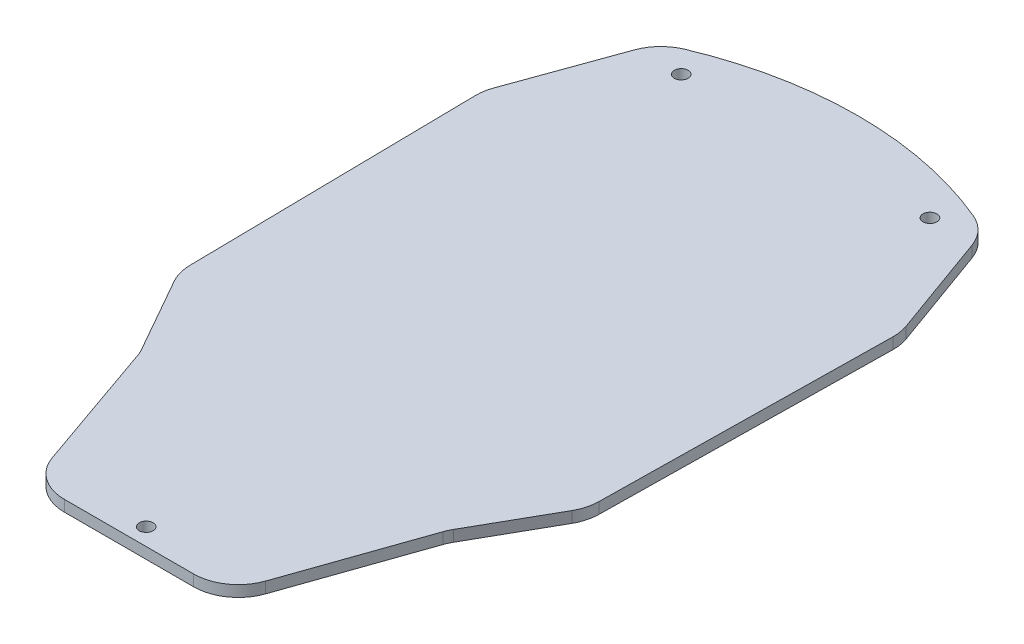
ISO-10303-21;
HEADER;
FILE_DESCRIPTION(('STEP AP214'),'2;1');
FILE_NAME('part.step','',(''),(''),'','','');
FILE_SCHEMA(('AUTOMOTIVE_DESIGN { 1 0 10303 214 1 1 1 1 }'));
ENDSEC;
DATA;
#1=APPLICATION_CONTEXT('core data for automotive mechanical design processes');
#2=APPLICATION_PROTOCOL_DEFINITION('international standard','automotive_design',2000,#1);
#3=PRODUCT_CONTEXT('',#1,'mechanical');
#4=PRODUCT('Part','Part','',(#3));
#5=PRODUCT_RELATED_PRODUCT_CATEGORY('part','',(#4));
#6=PRODUCT_DEFINITION_FORMATION('','',#4);
#7=PRODUCT_DEFINITION_CONTEXT('part definition',#1,'design');
#8=PRODUCT_DEFINITION('design','',#6,#7);
#9=PRODUCT_DEFINITION_SHAPE('','',#8);
#10=(LENGTH_UNIT() NAMED_UNIT(*) SI_UNIT(.MILLI.,.METRE.));
#11=(NAMED_UNIT(*) PLANE_ANGLE_UNIT() SI_UNIT($,.RADIAN.));
#12=(NAMED_UNIT(*) SI_UNIT($,.STERADIAN.) SOLID_ANGLE_UNIT());
#13=UNCERTAINTY_MEASURE_WITH_UNIT(LENGTH_MEASURE(1.E-05),#10,'distance_accuracy_value','');
#14=(GEOMETRIC_REPRESENTATION_CONTEXT(3) GLOBAL_UNCERTAINTY_ASSIGNED_CONTEXT((#13)) GLOBAL_UNIT_ASSIGNED_CONTEXT((#10,
#11,#12)) REPRESENTATION_CONTEXT('',''));
#15=CARTESIAN_POINT('',(0.,0.,0.));
#16=DIRECTION('',(0.,0.,1.));
#17=DIRECTION('',(1.,0.,0.));
#18=AXIS2_PLACEMENT_3D('',#15,#16,#17);
#19=CARTESIAN_POINT('',(-59.5778963500326,3.175,-162.152192035586));
#20=DIRECTION('',(-0.940552015487436,0.,-0.339649681528662));
#21=DIRECTION('',(-0.339649681528662,0.,0.940552015487436));
#22=AXIS2_PLACEMENT_3D('',#19,#20,#21);
#23=PLANE('',#22);
#24=DIRECTION('',(0.339649681528662,0.,-0.940552015487436));
#25=VECTOR('',#24,1.);
#26=CARTESIAN_POINT('',(-59.5778963500326,3.175,-162.152192035586));
#27=LINE('',#26,#25);
#28=CARTESIAN_POINT('',(-58.7896777469841,3.175,-164.334913339505));
#29=VERTEX_POINT('',#28);
#30=CARTESIAN_POINT('',(-48.1726179921892,3.175,-193.735491329095));
#31=VERTEX_POINT('',#30);
#32=EDGE_CURVE('E355',#29,#31,#27,.T.);
#33=ORIENTED_EDGE('',*,*,#32,.T.);
#34=DIRECTION('',(0.,-1.,0.));
#35=VECTOR('',#34,1.);
#36=CARTESIAN_POINT('',(-48.1726179921892,3.175,-193.735491329095));
#37=LINE('',#36,#35);
#38=CARTESIAN_POINT('',(-48.1726179921892,0.,-193.735491329095));
#39=VERTEX_POINT('',#38);
#40=EDGE_CURVE('E190',#31,#39,#37,.T.);
#41=ORIENTED_EDGE('',*,*,#40,.T.);
#42=DIRECTION('',(0.339649681528662,0.,-0.940552015487436));
#43=VECTOR('',#42,1.);
#44=CARTESIAN_POINT('',(-59.5778963500326,0.,-162.152192035586));
#45=LINE('',#44,#43);
#46=CARTESIAN_POINT('',(-58.7896777469841,0.,-164.334913339505));
#47=VERTEX_POINT('',#46);
#48=EDGE_CURVE('E174',#47,#39,#45,.T.);
#49=ORIENTED_EDGE('',*,*,#48,.F.);
#50=DIRECTION('',(0.,-1.,0.));
#51=VECTOR('',#50,1.);
#52=CARTESIAN_POINT('',(-58.7896777469841,3.175,-164.334913339505));
#53=LINE('',#52,#51);
#54=EDGE_CURVE('E187',#47,#29,#53,.F.);
#55=ORIENTED_EDGE('',*,*,#54,.T.);
#56=EDGE_LOOP('',(#33,#41,#49,#55));
#57=FACE_BOUND('',#56,.T.);
#58=ADVANCED_FACE('F33',(#57),#23,.T.);
#59=CARTESIAN_POINT('',(-58.2611403441786,3.175,-73.958269637992));
#60=DIRECTION('',(-0.999888562668412,0.,0.0149285714285713));
#61=DIRECTION('',(0.0149285714285713,0.,0.999888562668412));
#62=AXIS2_PLACEMENT_3D('',#59,#60,#61);
#63=PLANE('',#62);
#64=DIRECTION('',(-0.0149285714285713,0.,-0.999888562668412));
#65=VECTOR('',#64,1.);
#66=CARTESIAN_POINT('',(-58.2611403441786,0.,-73.958269637992));
#67=LINE('',#66,#65);
#68=CARTESIAN_POINT('',(-58.3096478434964,0.,-77.2072137183785));
#69=VERTEX_POINT('',#68);
#70=CARTESIAN_POINT('',(-59.5432518961825,0.,-159.831769526948));
#71=VERTEX_POINT('',#70);
#72=EDGE_CURVE('E176',#69,#71,#67,.T.);
#73=ORIENTED_EDGE('',*,*,#72,.F.);
#74=DIRECTION('',(0.,-1.,0.));
#75=VECTOR('',#74,1.);
#76=CARTESIAN_POINT('',(-58.3096478434964,3.175,-77.2072137183785));
#77=LINE('',#76,#75);
#78=CARTESIAN_POINT('',(-58.3096478434964,3.175,-77.2072137183785));
#79=VERTEX_POINT('',#78);
#80=EDGE_CURVE('E273',#69,#79,#77,.F.);
#81=ORIENTED_EDGE('',*,*,#80,.T.);
#82=DIRECTION('',(-0.0149285714285713,0.,-0.999888562668412));
#83=VECTOR('',#82,1.);
#84=CARTESIAN_POINT('',(-58.2611403441786,3.175,-73.958269637992));
#85=LINE('',#84,#83);
#86=CARTESIAN_POINT('',(-59.5432518961825,3.175,-159.831769526948));
#87=VERTEX_POINT('',#86);
#88=EDGE_CURVE('E197',#79,#87,#85,.T.);
#89=ORIENTED_EDGE('',*,*,#88,.T.);
#90=DIRECTION('',(0.,-1.,0.));
#91=VECTOR('',#90,1.);
#92=CARTESIAN_POINT('',(-59.5432518961825,3.175,-159.831769526948));
#93=LINE('',#92,#91);
#94=EDGE_CURVE('E271',#87,#71,#93,.T.);
#95=ORIENTED_EDGE('',*,*,#94,.T.);
#96=EDGE_LOOP('',(#73,#81,#89,#95));
#97=FACE_BOUND('',#96,.T.);
#98=ADVANCED_FACE('F401',(#97),#63,.T.);
#99=CARTESIAN_POINT('',(-43.8875961045043,3.175,-48.6130264916214));
#100=DIRECTION('',(-0.869856675044697,0.,0.493304535637149));
#101=DIRECTION('',(0.493304535637149,0.,0.869856675044698));
#102=AXIS2_PLACEMENT_3D('',#99,#100,#101);
#103=PLANE('',#102);
#104=DIRECTION('',(-0.493304535637149,0.,-0.869856675044698));
#105=VECTOR('',#104,1.);
#106=CARTESIAN_POINT('',(-43.8875961045043,0.,-48.6130264916214));
#107=LINE('',#106,#105);
#108=CARTESIAN_POINT('',(-44.4516474954024,0.,-49.6076329304357));
#109=VERTEX_POINT('',#108);
#110=CARTESIAN_POINT('',(-56.6582428706752,0.,-71.1318389729296));
#111=VERTEX_POINT('',#110);
#112=EDGE_CURVE('E281',#109,#111,#107,.T.);
#113=ORIENTED_EDGE('',*,*,#112,.F.);
#114=DIRECTION('',(0.,-1.,0.));
#115=VECTOR('',#114,1.);
#116=CARTESIAN_POINT('',(-44.4516474954024,3.175,-49.6076329304357));
#117=LINE('',#116,#115);
#118=CARTESIAN_POINT('',(-44.4516474954024,3.175,-49.6076329304357));
#119=VERTEX_POINT('',#118);
#120=EDGE_CURVE('E269',#109,#119,#117,.F.);
#121=ORIENTED_EDGE('',*,*,#120,.T.);
#122=DIRECTION('',(-0.493304535637149,0.,-0.869856675044698));
#123=VECTOR('',#122,1.);
#124=CARTESIAN_POINT('',(-43.8875961045043,3.175,-48.6130264916214));
#125=LINE('',#124,#123);
#126=CARTESIAN_POINT('',(-56.6582428706752,3.175,-71.1318389729296));
#127=VERTEX_POINT('',#126);
#128=EDGE_CURVE('E201',#119,#127,#125,.T.);
#129=ORIENTED_EDGE('',*,*,#128,.T.);
#130=DIRECTION('',(0.,-1.,0.));
#131=VECTOR('',#130,1.);
#132=CARTESIAN_POINT('',(-56.6582428706752,3.175,-71.1318389729296));
#133=LINE('',#132,#131);
#134=EDGE_CURVE('E266',#127,#111,#133,.T.);
#135=ORIENTED_EDGE('',*,*,#134,.T.);
#136=EDGE_LOOP('',(#113,#121,#129,#135));
#137=FACE_BOUND('',#136,.T.);
#138=ADVANCED_FACE('F288',(#137),#103,.T.);
#139=CARTESIAN_POINT('',(-27.4482558424307,3.175,-1.5875));
#140=DIRECTION('',(-0.943980932010811,0.,0.33));
#141=DIRECTION('',(0.33,0.,0.943980932010811));
#142=AXIS2_PLACEMENT_3D('',#139,#140,#141);
#143=PLANE('',#142);
#144=DIRECTION('',(-0.33,0.,-0.943980932010811));
#145=VECTOR('',#144,1.);
#146=CARTESIAN_POINT('',(-27.4482558424307,3.175,-1.5875));
#147=LINE('',#146,#145);
#148=CARTESIAN_POINT('',(-30.4228604184136,3.175,-10.0965));
#149=VERTEX_POINT('',#148);
#150=CARTESIAN_POINT('',(-43.5102694319328,3.175,-47.5336653278439));
#151=VERTEX_POINT('',#150);
#152=EDGE_CURVE('E298',#149,#151,#147,.T.);
#153=ORIENTED_EDGE('',*,*,#152,.T.);
#154=DIRECTION('',(0.,-1.,0.));
#155=VECTOR('',#154,1.);
#156=CARTESIAN_POINT('',(-43.5102694319328,0.,-47.5336653278439));
#157=LINE('',#156,#155);
#158=CARTESIAN_POINT('',(-43.5102694319328,0.,-47.5336653278439));
#159=VERTEX_POINT('',#158);
#160=EDGE_CURVE('E263',#151,#159,#157,.T.);
#161=ORIENTED_EDGE('',*,*,#160,.T.);
#162=DIRECTION('',(-0.33,0.,-0.943980932010811));
#163=VECTOR('',#162,1.);
#164=CARTESIAN_POINT('',(-27.4482558424307,0.,-1.5875));
#165=LINE('',#164,#163);
#166=CARTESIAN_POINT('',(-30.4228604184136,0.,-10.0965));
#167=VERTEX_POINT('',#166);
#168=EDGE_CURVE('E283',#167,#159,#165,.T.);
#169=ORIENTED_EDGE('',*,*,#168,.F.);
#170=DIRECTION('',(0.,-1.,0.));
#171=VECTOR('',#170,1.);
#172=CARTESIAN_POINT('',(-30.4228604184136,3.175,-10.0965));
#173=LINE('',#172,#171);
#174=EDGE_CURVE('E261',#167,#149,#173,.F.);
#175=ORIENTED_EDGE('',*,*,#174,.T.);
#176=EDGE_LOOP('',(#153,#161,#169,#175));
#177=FACE_BOUND('',#176,.T.);
#178=ADVANCED_FACE('F301',(#177),#143,.T.);
#179=CARTESIAN_POINT('',(-27.4482558424307,3.175,-1.5875));
#180=DIRECTION('',(0.,0.,-1.));
#181=DIRECTION('',(-1.,0.,0.));
#182=AXIS2_PLACEMENT_3D('',#179,#180,#181);
#183=PLANE('',#182);
#184=DIRECTION('',(1.,0.,0.));
#185=VECTOR('',#184,1.);
#186=CARTESIAN_POINT('',(-27.4482558424307,0.,-1.5875));
#187=LINE('',#186,#185);
#188=CARTESIAN_POINT('',(-18.4343025818763,0.,-1.5875));
#189=VERTEX_POINT('',#188);
#190=CARTESIAN_POINT('',(18.4343025818763,0.,-1.5875));
#191=VERTEX_POINT('',#190);
#192=EDGE_CURVE('E324',#189,#191,#187,.T.);
#193=ORIENTED_EDGE('',*,*,#192,.T.);
#194=DIRECTION('',(0.,-1.,0.));
#195=VECTOR('',#194,1.);
#196=CARTESIAN_POINT('',(18.4343025818763,3.175,-1.5875));
#197=LINE('',#196,#195);
#198=CARTESIAN_POINT('',(18.4343025818763,3.175,-1.5875));
#199=VERTEX_POINT('',#198);
#200=EDGE_CURVE('E259',#191,#199,#197,.F.);
#201=ORIENTED_EDGE('',*,*,#200,.T.);
#202=DIRECTION('',(1.,0.,0.));
#203=VECTOR('',#202,1.);
#204=CARTESIAN_POINT('',(-27.4482558424307,3.175,-1.5875));
#205=LINE('',#204,#203);
#206=CARTESIAN_POINT('',(-18.4343025818763,3.175,-1.5875));
#207=VERTEX_POINT('',#206);
#208=EDGE_CURVE('E303',#207,#199,#205,.T.);
#209=ORIENTED_EDGE('',*,*,#208,.F.);
#210=DIRECTION('',(0.,-1.,0.));
#211=VECTOR('',#210,1.);
#212=CARTESIAN_POINT('',(-18.4343025818763,0.,-1.5875));
#213=LINE('',#212,#211);
#214=EDGE_CURVE('E256',#207,#189,#213,.T.);
#215=ORIENTED_EDGE('',*,*,#214,.T.);
#216=EDGE_LOOP('',(#193,#201,#209,#215));
#217=FACE_BOUND('',#216,.T.);
#218=ADVANCED_FACE('F330',(#217),#183,.F.);
#219=CARTESIAN_POINT('',(27.4482558424307,3.175,-1.5875));
#220=DIRECTION('',(-0.943980932010811,0.,-0.33));
#221=DIRECTION('',(-0.33,0.,0.943980932010811));
#222=AXIS2_PLACEMENT_3D('',#219,#220,#221);
#223=PLANE('',#222);
#224=DIRECTION('',(0.33,0.,-0.943980932010811));
#225=VECTOR('',#224,1.);
#226=CARTESIAN_POINT('',(27.4482558424307,0.,-1.5875));
#227=LINE('',#226,#225);
#228=CARTESIAN_POINT('',(30.4228604184136,0.,-10.0965));
#229=VERTEX_POINT('',#228);
#230=CARTESIAN_POINT('',(43.5102694319328,0.,-47.533665327844));
#231=VERTEX_POINT('',#230);
#232=EDGE_CURVE('E321',#229,#231,#227,.T.);
#233=ORIENTED_EDGE('',*,*,#232,.T.);
#234=DIRECTION('',(0.,-1.,0.));
#235=VECTOR('',#234,1.);
#236=CARTESIAN_POINT('',(43.5102694319328,3.175,-47.533665327844));
#237=LINE('',#236,#235);
#238=CARTESIAN_POINT('',(43.5102694319328,3.175,-47.533665327844));
#239=VERTEX_POINT('',#238);
#240=EDGE_CURVE('E254',#231,#239,#237,.F.);
#241=ORIENTED_EDGE('',*,*,#240,.T.);
#242=DIRECTION('',(0.33,0.,-0.943980932010811));
#243=VECTOR('',#242,1.);
#244=CARTESIAN_POINT('',(27.4482558424307,3.175,-1.5875));
#245=LINE('',#244,#243);
#246=CARTESIAN_POINT('',(30.4228604184136,3.175,-10.0965));
#247=VERTEX_POINT('',#246);
#248=EDGE_CURVE('E307',#247,#239,#245,.T.);
#249=ORIENTED_EDGE('',*,*,#248,.F.);
#250=DIRECTION('',(0.,-1.,0.));
#251=VECTOR('',#250,1.);
#252=CARTESIAN_POINT('',(30.4228604184136,3.175,-10.0965));
#253=LINE('',#252,#251);
#254=EDGE_CURVE('E251',#247,#229,#253,.T.);
#255=ORIENTED_EDGE('',*,*,#254,.T.);
#256=EDGE_LOOP('',(#233,#241,#249,#255));
#257=FACE_BOUND('',#256,.T.);
#258=ADVANCED_FACE('F341',(#257),#223,.F.);
#259=CARTESIAN_POINT('',(43.8875961045043,3.175,-48.6130264916214));
#260=DIRECTION('',(-0.869856675044697,0.,-0.493304535637149));
#261=DIRECTION('',(-0.493304535637149,0.,0.869856675044698));
#262=AXIS2_PLACEMENT_3D('',#259,#260,#261);
#263=PLANE('',#262);
#264=DIRECTION('',(0.493304535637149,0.,-0.869856675044698));
#265=VECTOR('',#264,1.);
#266=CARTESIAN_POINT('',(43.8875961045043,0.,-48.6130264916214));
#267=LINE('',#266,#265);
#268=CARTESIAN_POINT('',(44.4516474954025,0.,-49.6076329304357));
#269=VERTEX_POINT('',#268);
#270=CARTESIAN_POINT('',(56.6582428706752,0.,-71.1318389729296));
#271=VERTEX_POINT('',#270);
#272=EDGE_CURVE('E318',#269,#271,#267,.T.);
#273=ORIENTED_EDGE('',*,*,#272,.T.);
#274=DIRECTION('',(0.,-1.,0.));
#275=VECTOR('',#274,1.);
#276=CARTESIAN_POINT('',(56.6582428706752,3.175,-71.1318389729296));
#277=LINE('',#276,#275);
#278=CARTESIAN_POINT('',(56.6582428706752,3.175,-71.1318389729296));
#279=VERTEX_POINT('',#278);
#280=EDGE_CURVE('E249',#271,#279,#277,.F.);
#281=ORIENTED_EDGE('',*,*,#280,.T.);
#282=DIRECTION('',(0.493304535637149,0.,-0.869856675044698));
#283=VECTOR('',#282,1.);
#284=CARTESIAN_POINT('',(43.8875961045043,3.175,-48.6130264916214));
#285=LINE('',#284,#283);
#286=CARTESIAN_POINT('',(44.4516474954025,3.175,-49.6076329304357));
#287=VERTEX_POINT('',#286);
#288=EDGE_CURVE('E344',#287,#279,#285,.T.);
#289=ORIENTED_EDGE('',*,*,#288,.F.);
#290=DIRECTION('',(0.,-1.,0.));
#291=VECTOR('',#290,1.);
#292=CARTESIAN_POINT('',(44.4516474954025,0.,-49.6076329304357));
#293=LINE('',#292,#291);
#294=EDGE_CURVE('E246',#287,#269,#293,.T.);
#295=ORIENTED_EDGE('',*,*,#294,.T.);
#296=EDGE_LOOP('',(#273,#281,#289,#295));
#297=FACE_BOUND('',#296,.T.);
#298=ADVANCED_FACE('F528',(#297),#263,.F.);
#299=CARTESIAN_POINT('',(58.2611403441786,3.175,-73.958269637992));
#300=DIRECTION('',(-0.999888562668412,0.,-0.0149285714285713));
#301=DIRECTION('',(-0.0149285714285713,0.,0.999888562668412));
#302=AXIS2_PLACEMENT_3D('',#299,#300,#301);
#303=PLANE('',#302);
#304=DIRECTION('',(0.0149285714285713,0.,-0.999888562668412));
#305=VECTOR('',#304,1.);
#306=CARTESIAN_POINT('',(58.2611403441786,0.,-73.958269637992));
#307=LINE('',#306,#305);
#308=CARTESIAN_POINT('',(58.3096478434964,0.,-77.2072137183785));
#309=VERTEX_POINT('',#308);
#310=CARTESIAN_POINT('',(59.5432518961825,0.,-159.831769526948));
#311=VERTEX_POINT('',#310);
#312=EDGE_CURVE('E315',#309,#311,#307,.T.);
#313=ORIENTED_EDGE('',*,*,#312,.T.);
#314=DIRECTION('',(0.,-1.,0.));
#315=VECTOR('',#314,1.);
#316=CARTESIAN_POINT('',(59.5432518961825,3.175,-159.831769526948));
#317=LINE('',#316,#315);
#318=CARTESIAN_POINT('',(59.5432518961825,3.175,-159.831769526948));
#319=VERTEX_POINT('',#318);
#320=EDGE_CURVE('E244',#311,#319,#317,.F.);
#321=ORIENTED_EDGE('',*,*,#320,.T.);
#322=DIRECTION('',(0.0149285714285713,0.,-0.999888562668412));
#323=VECTOR('',#322,1.);
#324=CARTESIAN_POINT('',(58.2611403441786,3.175,-73.958269637992));
#325=LINE('',#324,#323);
#326=CARTESIAN_POINT('',(58.3096478434964,3.175,-77.2072137183785));
#327=VERTEX_POINT('',#326);
#328=EDGE_CURVE('E346',#327,#319,#325,.T.);
#329=ORIENTED_EDGE('',*,*,#328,.F.);
#330=DIRECTION('',(0.,-1.,0.));
#331=VECTOR('',#330,1.);
#332=CARTESIAN_POINT('',(58.3096478434964,3.175,-77.2072137183785));
#333=LINE('',#332,#331);
#334=EDGE_CURVE('E241',#327,#309,#333,.T.);
#335=ORIENTED_EDGE('',*,*,#334,.T.);
#336=EDGE_LOOP('',(#313,#321,#329,#335));
#337=FACE_BOUND('',#336,.T.);
#338=ADVANCED_FACE('F522',(#337),#303,.F.);
#339=CARTESIAN_POINT('',(59.5778963500326,3.175,-162.152192035586));
#340=DIRECTION('',(-0.940552015487436,0.,0.339649681528662));
#341=DIRECTION('',(0.339649681528662,0.,0.940552015487436));
#342=AXIS2_PLACEMENT_3D('',#339,#340,#341);
#343=PLANE('',#342);
#344=DIRECTION('',(-0.339649681528662,0.,-0.940552015487436));
#345=VECTOR('',#344,1.);
#346=CARTESIAN_POINT('',(59.5778963500326,0.,-162.152192035586));
#347=LINE('',#346,#345);
#348=CARTESIAN_POINT('',(58.7896777469841,0.,-164.334913339505));
#349=VERTEX_POINT('',#348);
#350=CARTESIAN_POINT('',(48.1726179921892,0.,-193.735491329095));
#351=VERTEX_POINT('',#350);
#352=EDGE_CURVE('E313',#349,#351,#347,.T.);
#353=ORIENTED_EDGE('',*,*,#352,.T.);
#354=DIRECTION('',(0.,1.,0.));
#355=VECTOR('',#354,1.);
#356=CARTESIAN_POINT('',(48.1726179921892,3.175,-193.735491329095));
#357=LINE('',#356,#355);
#358=CARTESIAN_POINT('',(48.1726179921892,3.175,-193.735491329095));
#359=VERTEX_POINT('',#358);
#360=EDGE_CURVE('E48',#351,#359,#357,.T.);
#361=ORIENTED_EDGE('',*,*,#360,.T.);
#362=DIRECTION('',(-0.339649681528662,0.,-0.940552015487436));
#363=VECTOR('',#362,1.);
#364=CARTESIAN_POINT('',(59.5778963500326,3.175,-162.152192035586));
#365=LINE('',#364,#363);
#366=CARTESIAN_POINT('',(58.7896777469841,3.175,-164.334913339505));
#367=VERTEX_POINT('',#366);
#368=EDGE_CURVE('E350',#367,#359,#365,.T.);
#369=ORIENTED_EDGE('',*,*,#368,.F.);
#370=DIRECTION('',(0.,-1.,0.));
#371=VECTOR('',#370,1.);
#372=CARTESIAN_POINT('',(58.7896777469841,3.175,-164.334913339505));
#373=LINE('',#372,#371);
#374=EDGE_CURVE('E237',#367,#349,#373,.T.);
#375=ORIENTED_EDGE('',*,*,#374,.T.);
#376=EDGE_LOOP('',(#353,#361,#369,#375));
#377=FACE_BOUND('',#376,.T.);
#378=ADVANCED_FACE('F515',(#377),#343,.F.);
#379=CARTESIAN_POINT('',(0.,3.175,-103.049349995439));
#380=DIRECTION('',(0.,-1.,0.));
#381=DIRECTION('',(0.,0.,-1.));
#382=AXIS2_PLACEMENT_3D('',#379,#380,#381);
#383=CYLINDRICAL_SURFACE('',#382,106.3625);
#384=CARTESIAN_POINT('',(0.,0.,-103.049349995439));
#385=DIRECTION('',(0.,-1.,0.));
#386=DIRECTION('',(0.,0.,-1.));
#387=AXIS2_PLACEMENT_3D('',#384,#385,#386);
#388=CIRCLE('',#387,106.3625);
#389=CARTESIAN_POINT('',(-41.1398253474308,0.,-201.133478052087));
#390=VERTEX_POINT('',#389);
#391=CARTESIAN_POINT('',(41.1398253474308,0.,-201.133478052087));
#392=VERTEX_POINT('',#391);
#393=EDGE_CURVE('E191',#390,#392,#388,.T.);
#394=ORIENTED_EDGE('',*,*,#393,.F.);
#395=DIRECTION('',(0.,-1.,0.));
#396=VECTOR('',#395,1.);
#397=CARTESIAN_POINT('',(-41.1398253474307,3.175,-201.133478052087));
#398=LINE('',#397,#396);
#399=CARTESIAN_POINT('',(-41.1398253474308,3.175,-201.133478052087));
#400=VERTEX_POINT('',#399);
#401=EDGE_CURVE('E221',#390,#400,#398,.F.);
#402=ORIENTED_EDGE('',*,*,#401,.T.);
#403=CARTESIAN_POINT('',(0.,3.175,-103.049349995439));
#404=DIRECTION('',(0.,-1.,0.));
#405=DIRECTION('',(0.,0.,-1.));
#406=AXIS2_PLACEMENT_3D('',#403,#404,#405);
#407=CIRCLE('',#406,106.3625);
#408=CARTESIAN_POINT('',(41.1398253474308,3.175,-201.133478052087));
#409=VERTEX_POINT('',#408);
#410=EDGE_CURVE('E352',#400,#409,#407,.T.);
#411=ORIENTED_EDGE('',*,*,#410,.T.);
#412=DIRECTION('',(0.,-1.,0.));
#413=VECTOR('',#412,1.);
#414=CARTESIAN_POINT('',(41.1398253474307,3.175,-201.133478052087));
#415=LINE('',#414,#413);
#416=EDGE_CURVE('E218',#409,#392,#415,.T.);
#417=ORIENTED_EDGE('',*,*,#416,.T.);
#418=EDGE_LOOP('',(#394,#402,#411,#417));
#419=FACE_BOUND('',#418,.T.);
#420=ADVANCED_FACE('F379',(#419),#383,.T.);
#421=CARTESIAN_POINT('',(0.,3.175,-103.049349995439));
#422=DIRECTION('',(0.,-1.,0.));
#423=DIRECTION('',(0.,0.,-1.));
#424=AXIS2_PLACEMENT_3D('',#421,#422,#423);
#425=PLANE('',#424);
#426=CARTESIAN_POINT('',(0.,3.175,-6.48335));
#427=DIRECTION('',(0.,1.,0.));
#428=DIRECTION('',(0.,0.,1.));
#429=AXIS2_PLACEMENT_3D('',#426,#427,#428);
#430=CIRCLE('',#429,1.98437499999999);
#431=CARTESIAN_POINT('',(0.,3.175,-4.49897500000001));
#432=VERTEX_POINT('',#431);
#433=EDGE_CURVE('E371',#432,#432,#430,.T.);
#434=ORIENTED_EDGE('',*,*,#433,.F.);
#435=EDGE_LOOP('',(#434));
#436=FACE_BOUND('',#435,.T.);
#437=CARTESIAN_POINT('',(-35.45205,3.175,-194.449583063944));
#438=DIRECTION('',(0.,1.,0.));
#439=DIRECTION('',(0.,0.,1.));
#440=AXIS2_PLACEMENT_3D('',#437,#438,#439);
#441=CIRCLE('',#440,1.984375);
#442=CARTESIAN_POINT('',(-35.45205,3.175,-192.465208063944));
#443=VERTEX_POINT('',#442);
#444=EDGE_CURVE('E365',#443,#443,#441,.T.);
#445=ORIENTED_EDGE('',*,*,#444,.F.);
#446=EDGE_LOOP('',(#445));
#447=FACE_BOUND('',#446,.T.);
#448=CARTESIAN_POINT('',(35.45205,3.175,-194.449583063944));
#449=DIRECTION('',(0.,1.,0.));
#450=DIRECTION('',(0.,0.,1.));
#451=AXIS2_PLACEMENT_3D('',#448,#449,#450);
#452=CIRCLE('',#451,1.984375);
#453=CARTESIAN_POINT('',(35.45205,3.175,-192.465208063944));
#454=VERTEX_POINT('',#453);
#455=EDGE_CURVE('E359',#454,#454,#452,.T.);
#456=ORIENTED_EDGE('',*,*,#455,.F.);
#457=EDGE_LOOP('',(#456));
#458=FACE_BOUND('',#457,.T.);
#459=ORIENTED_EDGE('',*,*,#410,.F.);
#460=CARTESIAN_POINT('',(-36.2276073954987,3.175,-189.421940373681));
#461=DIRECTION('',(0.,-1.,0.));
#462=DIRECTION('',(0.,0.,-1.));
#463=AXIS2_PLACEMENT_3D('',#460,#461,#462);
#464=CIRCLE('',#463,12.7);
#465=EDGE_CURVE('E235',#400,#31,#464,.F.);
#466=ORIENTED_EDGE('',*,*,#465,.T.);
#467=ORIENTED_EDGE('',*,*,#32,.F.);
#468=CARTESIAN_POINT('',(-46.8446671502936,3.175,-160.021362384091));
#469=DIRECTION('',(0.,-1.,0.));
#470=DIRECTION('',(0.,0.,-1.));
#471=AXIS2_PLACEMENT_3D('',#468,#469,#470);
#472=CIRCLE('',#471,12.7);
#473=EDGE_CURVE('E196',#29,#87,#472,.F.);
#474=ORIENTED_EDGE('',*,*,#473,.T.);
#475=ORIENTED_EDGE('',*,*,#88,.F.);
#476=CARTESIAN_POINT('',(-45.6110630976076,3.175,-77.3968065755214));
#477=DIRECTION('',(0.,-1.,0.));
#478=DIRECTION('',(0.,0.,-1.));
#479=AXIS2_PLACEMENT_3D('',#476,#477,#478);
#480=CIRCLE('',#479,12.7);
#481=EDGE_CURVE('E226',#79,#127,#480,.F.);
#482=ORIENTED_EDGE('',*,*,#481,.T.);
#483=ORIENTED_EDGE('',*,*,#128,.F.);
#484=CARTESIAN_POINT('',(-55.4988272684701,3.175,-43.3426653278439));
#485=DIRECTION('',(0.,-1.,0.));
#486=DIRECTION('',(0.,0.,-1.));
#487=AXIS2_PLACEMENT_3D('',#484,#485,#486);
#488=CIRCLE('',#487,12.7);
#489=EDGE_CURVE('E11',#119,#151,#488,.T.);
#490=ORIENTED_EDGE('',*,*,#489,.T.);
#491=ORIENTED_EDGE('',*,*,#152,.F.);
#492=CARTESIAN_POINT('',(-18.4343025818763,3.175,-14.2875));
#493=DIRECTION('',(0.,-1.,0.));
#494=DIRECTION('',(0.,0.,-1.));
#495=AXIS2_PLACEMENT_3D('',#492,#493,#494);
#496=CIRCLE('',#495,12.7);
#497=EDGE_CURVE('E223',#149,#207,#496,.F.);
#498=ORIENTED_EDGE('',*,*,#497,.T.);
#499=ORIENTED_EDGE('',*,*,#208,.T.);
#500=CARTESIAN_POINT('',(18.4343025818763,3.175,-14.2875));
#501=DIRECTION('',(0.,-1.,0.));
#502=DIRECTION('',(0.,0.,-1.));
#503=AXIS2_PLACEMENT_3D('',#500,#501,#502);
#504=CIRCLE('',#503,12.7);
#505=EDGE_CURVE('E228',#199,#247,#504,.F.);
#506=ORIENTED_EDGE('',*,*,#505,.T.);
#507=ORIENTED_EDGE('',*,*,#248,.T.);
#508=CARTESIAN_POINT('',(55.4988272684701,3.175,-43.342665327844));
#509=DIRECTION('',(0.,-1.,0.));
#510=DIRECTION('',(0.,0.,-1.));
#511=AXIS2_PLACEMENT_3D('',#508,#509,#510);
#512=CIRCLE('',#511,12.7);
#513=EDGE_CURVE('E277',#239,#287,#512,.T.);
#514=ORIENTED_EDGE('',*,*,#513,.T.);
#515=ORIENTED_EDGE('',*,*,#288,.T.);
#516=CARTESIAN_POINT('',(45.6110630976076,3.175,-77.3968065755214));
#517=DIRECTION('',(0.,-1.,0.));
#518=DIRECTION('',(0.,0.,-1.));
#519=AXIS2_PLACEMENT_3D('',#516,#517,#518);
#520=CIRCLE('',#519,12.7);
#521=EDGE_CURVE('E230',#279,#327,#520,.F.);
#522=ORIENTED_EDGE('',*,*,#521,.T.);
#523=ORIENTED_EDGE('',*,*,#328,.T.);
#524=CARTESIAN_POINT('',(46.8446671502936,3.175,-160.021362384091));
#525=DIRECTION('',(0.,-1.,0.));
#526=DIRECTION('',(0.,0.,-1.));
#527=AXIS2_PLACEMENT_3D('',#524,#525,#526);
#528=CIRCLE('',#527,12.7);
#529=EDGE_CURVE('E55',#319,#367,#528,.F.);
#530=ORIENTED_EDGE('',*,*,#529,.T.);
#531=ORIENTED_EDGE('',*,*,#368,.T.);
#532=CARTESIAN_POINT('',(36.2276073954987,3.175,-189.421940373681));
#533=DIRECTION('',(0.,-1.,0.));
#534=DIRECTION('',(0.,0.,-1.));
#535=AXIS2_PLACEMENT_3D('',#532,#533,#534);
#536=CIRCLE('',#535,12.7);
#537=EDGE_CURVE('E233',#359,#409,#536,.F.);
#538=ORIENTED_EDGE('',*,*,#537,.T.);
#539=EDGE_LOOP('',(#459,#466,#467,#474,#475,#482,#483,#490,#491,#498,#499,#506,#507,#514,#515,
#522,#523,#530,#531,#538));
#540=FACE_BOUND('',#539,.T.);
#541=ADVANCED_FACE('F297',(#436,#447,#458,#540),#425,.F.);
#542=CARTESIAN_POINT('',(0.,0.,-103.049349995439));
#543=DIRECTION('',(0.,-1.,0.));
#544=DIRECTION('',(0.,0.,-1.));
#545=AXIS2_PLACEMENT_3D('',#542,#543,#544);
#546=PLANE('',#545);
#547=CARTESIAN_POINT('',(0.,0.,-6.48335));
#548=DIRECTION('',(0.,1.,0.));
#549=DIRECTION('',(0.,0.,1.));
#550=AXIS2_PLACEMENT_3D('',#547,#548,#549);
#551=CIRCLE('',#550,1.98437499999999);
#552=CARTESIAN_POINT('',(0.,0.,-4.49897500000001));
#553=VERTEX_POINT('',#552);
#554=EDGE_CURVE('E368',#553,#553,#551,.T.);
#555=ORIENTED_EDGE('',*,*,#554,.T.);
#556=EDGE_LOOP('',(#555));
#557=FACE_BOUND('',#556,.T.);
#558=CARTESIAN_POINT('',(-35.45205,0.,-194.449583063944));
#559=DIRECTION('',(0.,1.,0.));
#560=DIRECTION('',(0.,0.,1.));
#561=AXIS2_PLACEMENT_3D('',#558,#559,#560);
#562=CIRCLE('',#561,1.984375);
#563=CARTESIAN_POINT('',(-35.45205,0.,-192.465208063944));
#564=VERTEX_POINT('',#563);
#565=EDGE_CURVE('E362',#564,#564,#562,.T.);
#566=ORIENTED_EDGE('',*,*,#565,.T.);
#567=EDGE_LOOP('',(#566));
#568=FACE_BOUND('',#567,.T.);
#569=CARTESIAN_POINT('',(35.45205,0.,-194.449583063944));
#570=DIRECTION('',(0.,1.,0.));
#571=DIRECTION('',(0.,0.,1.));
#572=AXIS2_PLACEMENT_3D('',#569,#570,#571);
#573=CIRCLE('',#572,1.984375);
#574=CARTESIAN_POINT('',(35.45205,0.,-192.465208063944));
#575=VERTEX_POINT('',#574);
#576=EDGE_CURVE('E192',#575,#575,#573,.T.);
#577=ORIENTED_EDGE('',*,*,#576,.T.);
#578=EDGE_LOOP('',(#577));
#579=FACE_BOUND('',#578,.T.);
#580=ORIENTED_EDGE('',*,*,#48,.T.);
#581=CARTESIAN_POINT('',(-36.2276073954987,0.,-189.421940373681));
#582=DIRECTION('',(0.,-1.,0.));
#583=DIRECTION('',(0.,0.,-1.));
#584=AXIS2_PLACEMENT_3D('',#581,#582,#583);
#585=CIRCLE('',#584,12.7);
#586=EDGE_CURVE('E216',#39,#390,#585,.T.);
#587=ORIENTED_EDGE('',*,*,#586,.T.);
#588=ORIENTED_EDGE('',*,*,#393,.T.);
#589=CARTESIAN_POINT('',(36.2276073954987,0.,-189.421940373681));
#590=DIRECTION('',(0.,-1.,0.));
#591=DIRECTION('',(0.,0.,-1.));
#592=AXIS2_PLACEMENT_3D('',#589,#590,#591);
#593=CIRCLE('',#592,12.7);
#594=EDGE_CURVE('E214',#392,#351,#593,.T.);
#595=ORIENTED_EDGE('',*,*,#594,.T.);
#596=ORIENTED_EDGE('',*,*,#352,.F.);
#597=CARTESIAN_POINT('',(46.8446671502936,0.,-160.021362384091));
#598=DIRECTION('',(0.,-1.,0.));
#599=DIRECTION('',(0.,0.,-1.));
#600=AXIS2_PLACEMENT_3D('',#597,#598,#599);
#601=CIRCLE('',#600,12.7);
#602=EDGE_CURVE('E212',#349,#311,#601,.T.);
#603=ORIENTED_EDGE('',*,*,#602,.T.);
#604=ORIENTED_EDGE('',*,*,#312,.F.);
#605=CARTESIAN_POINT('',(45.6110630976076,0.,-77.3968065755214));
#606=DIRECTION('',(0.,-1.,0.));
#607=DIRECTION('',(0.,0.,-1.));
#608=AXIS2_PLACEMENT_3D('',#605,#606,#607);
#609=CIRCLE('',#608,12.7);
#610=EDGE_CURVE('E210',#309,#271,#609,.T.);
#611=ORIENTED_EDGE('',*,*,#610,.T.);
#612=ORIENTED_EDGE('',*,*,#272,.F.);
#613=CARTESIAN_POINT('',(55.4988272684701,0.,-43.342665327844));
#614=DIRECTION('',(0.,-1.,0.));
#615=DIRECTION('',(0.,0.,-1.));
#616=AXIS2_PLACEMENT_3D('',#613,#614,#615);
#617=CIRCLE('',#616,12.7);
#618=EDGE_CURVE('E275',#269,#231,#617,.F.);
#619=ORIENTED_EDGE('',*,*,#618,.T.);
#620=ORIENTED_EDGE('',*,*,#232,.F.);
#621=CARTESIAN_POINT('',(18.4343025818763,0.,-14.2875));
#622=DIRECTION('',(0.,-1.,0.));
#623=DIRECTION('',(0.,0.,-1.));
#624=AXIS2_PLACEMENT_3D('',#621,#622,#623);
#625=CIRCLE('',#624,12.7);
#626=EDGE_CURVE('E208',#229,#191,#625,.T.);
#627=ORIENTED_EDGE('',*,*,#626,.T.);
#628=ORIENTED_EDGE('',*,*,#192,.F.);
#629=CARTESIAN_POINT('',(-18.4343025818763,0.,-14.2875));
#630=DIRECTION('',(0.,-1.,0.));
#631=DIRECTION('',(0.,0.,-1.));
#632=AXIS2_PLACEMENT_3D('',#629,#630,#631);
#633=CIRCLE('',#632,12.7);
#634=EDGE_CURVE('E182',#189,#167,#633,.T.);
#635=ORIENTED_EDGE('',*,*,#634,.T.);
#636=ORIENTED_EDGE('',*,*,#168,.T.);
#637=CARTESIAN_POINT('',(-55.4988272684701,0.,-43.3426653278439));
#638=DIRECTION('',(0.,-1.,0.));
#639=DIRECTION('',(0.,0.,-1.));
#640=AXIS2_PLACEMENT_3D('',#637,#638,#639);
#641=CIRCLE('',#640,12.7);
#642=EDGE_CURVE('E41',#159,#109,#641,.F.);
#643=ORIENTED_EDGE('',*,*,#642,.T.);
#644=ORIENTED_EDGE('',*,*,#112,.T.);
#645=CARTESIAN_POINT('',(-45.6110630976076,0.,-77.3968065755214));
#646=DIRECTION('',(0.,-1.,0.));
#647=DIRECTION('',(0.,0.,-1.));
#648=AXIS2_PLACEMENT_3D('',#645,#646,#647);
#649=CIRCLE('',#648,12.7);
#650=EDGE_CURVE('E181',#111,#69,#649,.T.);
#651=ORIENTED_EDGE('',*,*,#650,.T.);
#652=ORIENTED_EDGE('',*,*,#72,.T.);
#653=CARTESIAN_POINT('',(-46.8446671502936,0.,-160.021362384091));
#654=DIRECTION('',(0.,-1.,0.));
#655=DIRECTION('',(0.,0.,-1.));
#656=AXIS2_PLACEMENT_3D('',#653,#654,#655);
#657=CIRCLE('',#656,12.7);
#658=EDGE_CURVE('E171',#71,#47,#657,.T.);
#659=ORIENTED_EDGE('',*,*,#658,.T.);
#660=EDGE_LOOP('',(#580,#587,#588,#595,#596,#603,#604,#611,#612,#619,#620,#627,#628,#635,#636,
#643,#644,#651,#652,#659));
#661=FACE_BOUND('',#660,.T.);
#662=ADVANCED_FACE('F173',(#557,#568,#579,#661),#546,.T.);
#663=CARTESIAN_POINT('',(35.45205,3.175,-194.449583063944));
#664=DIRECTION('',(0.,1.,0.));
#665=DIRECTION('',(0.,0.,1.));
#666=AXIS2_PLACEMENT_3D('',#663,#664,#665);
#667=CYLINDRICAL_SURFACE('',#666,1.984375);
#668=ORIENTED_EDGE('',*,*,#576,.F.);
#669=EDGE_LOOP('',(#668));
#670=FACE_BOUND('',#669,.T.);
#671=ORIENTED_EDGE('',*,*,#455,.T.);
#672=EDGE_LOOP('',(#671));
#673=FACE_BOUND('',#672,.T.);
#674=ADVANCED_FACE('F385',(#670,#673),#667,.F.);
#675=CARTESIAN_POINT('',(-35.45205,3.175,-194.449583063944));
#676=DIRECTION('',(0.,1.,0.));
#677=DIRECTION('',(0.,0.,1.));
#678=AXIS2_PLACEMENT_3D('',#675,#676,#677);
#679=CYLINDRICAL_SURFACE('',#678,1.984375);
#680=ORIENTED_EDGE('',*,*,#565,.F.);
#681=EDGE_LOOP('',(#680));
#682=FACE_BOUND('',#681,.T.);
#683=ORIENTED_EDGE('',*,*,#444,.T.);
#684=EDGE_LOOP('',(#683));
#685=FACE_BOUND('',#684,.T.);
#686=ADVANCED_FACE('F387',(#682,#685),#679,.F.);
#687=CARTESIAN_POINT('',(0.,3.175,-6.48335));
#688=DIRECTION('',(0.,1.,0.));
#689=DIRECTION('',(0.,0.,1.));
#690=AXIS2_PLACEMENT_3D('',#687,#688,#689);
#691=CYLINDRICAL_SURFACE('',#690,1.98437499999999);
#692=ORIENTED_EDGE('',*,*,#554,.F.);
#693=EDGE_LOOP('',(#692));
#694=FACE_BOUND('',#693,.T.);
#695=ORIENTED_EDGE('',*,*,#433,.T.);
#696=EDGE_LOOP('',(#695));
#697=FACE_BOUND('',#696,.T.);
#698=ADVANCED_FACE('F375',(#694,#697),#691,.F.);
#699=CARTESIAN_POINT('',(-36.2276073954987,3.175,-189.421940373681));
#700=DIRECTION('',(0.,-1.,0.));
#701=DIRECTION('',(0.,0.,-1.));
#702=AXIS2_PLACEMENT_3D('',#699,#700,#701);
#703=CYLINDRICAL_SURFACE('',#702,12.7);
#704=ORIENTED_EDGE('',*,*,#465,.F.);
#705=ORIENTED_EDGE('',*,*,#401,.F.);
#706=ORIENTED_EDGE('',*,*,#586,.F.);
#707=ORIENTED_EDGE('',*,*,#40,.F.);
#708=EDGE_LOOP('',(#704,#705,#706,#707));
#709=FACE_BOUND('',#708,.T.);
#710=ADVANCED_FACE('F412',(#709),#703,.T.);
#711=CARTESIAN_POINT('',(36.2276073954987,3.175,-189.421940373681));
#712=DIRECTION('',(0.,-1.,0.));
#713=DIRECTION('',(0.,0.,-1.));
#714=AXIS2_PLACEMENT_3D('',#711,#712,#713);
#715=CYLINDRICAL_SURFACE('',#714,12.7);
#716=ORIENTED_EDGE('',*,*,#537,.F.);
#717=ORIENTED_EDGE('',*,*,#360,.F.);
#718=ORIENTED_EDGE('',*,*,#594,.F.);
#719=ORIENTED_EDGE('',*,*,#416,.F.);
#720=EDGE_LOOP('',(#716,#717,#718,#719));
#721=FACE_BOUND('',#720,.T.);
#722=ADVANCED_FACE('F415',(#721),#715,.T.);
#723=CARTESIAN_POINT('',(46.8446671502936,3.175,-160.021362384091));
#724=DIRECTION('',(0.,-1.,0.));
#725=DIRECTION('',(0.,0.,-1.));
#726=AXIS2_PLACEMENT_3D('',#723,#724,#725);
#727=CYLINDRICAL_SURFACE('',#726,12.7);
#728=ORIENTED_EDGE('',*,*,#529,.F.);
#729=ORIENTED_EDGE('',*,*,#320,.F.);
#730=ORIENTED_EDGE('',*,*,#602,.F.);
#731=ORIENTED_EDGE('',*,*,#374,.F.);
#732=EDGE_LOOP('',(#728,#729,#730,#731));
#733=FACE_BOUND('',#732,.T.);
#734=ADVANCED_FACE('F419',(#733),#727,.T.);
#735=CARTESIAN_POINT('',(45.6110630976076,3.175,-77.3968065755214));
#736=DIRECTION('',(0.,-1.,0.));
#737=DIRECTION('',(0.,0.,-1.));
#738=AXIS2_PLACEMENT_3D('',#735,#736,#737);
#739=CYLINDRICAL_SURFACE('',#738,12.7);
#740=ORIENTED_EDGE('',*,*,#521,.F.);
#741=ORIENTED_EDGE('',*,*,#280,.F.);
#742=ORIENTED_EDGE('',*,*,#610,.F.);
#743=ORIENTED_EDGE('',*,*,#334,.F.);
#744=EDGE_LOOP('',(#740,#741,#742,#743));
#745=FACE_BOUND('',#744,.T.);
#746=ADVANCED_FACE('F423',(#745),#739,.T.);
#747=CARTESIAN_POINT('',(55.4988272684701,3.175,-43.342665327844));
#748=DIRECTION('',(0.,1.,0.));
#749=DIRECTION('',(0.,0.,1.));
#750=AXIS2_PLACEMENT_3D('',#747,#748,#749);
#751=CYLINDRICAL_SURFACE('',#750,12.7);
#752=ORIENTED_EDGE('',*,*,#513,.F.);
#753=ORIENTED_EDGE('',*,*,#240,.F.);
#754=ORIENTED_EDGE('',*,*,#618,.F.);
#755=ORIENTED_EDGE('',*,*,#294,.F.);
#756=EDGE_LOOP('',(#752,#753,#754,#755));
#757=FACE_BOUND('',#756,.T.);
#758=ADVANCED_FACE('F427',(#757),#751,.F.);
#759=CARTESIAN_POINT('',(18.4343025818763,3.175,-14.2875));
#760=DIRECTION('',(0.,-1.,0.));
#761=DIRECTION('',(0.,0.,-1.));
#762=AXIS2_PLACEMENT_3D('',#759,#760,#761);
#763=CYLINDRICAL_SURFACE('',#762,12.7);
#764=ORIENTED_EDGE('',*,*,#505,.F.);
#765=ORIENTED_EDGE('',*,*,#200,.F.);
#766=ORIENTED_EDGE('',*,*,#626,.F.);
#767=ORIENTED_EDGE('',*,*,#254,.F.);
#768=EDGE_LOOP('',(#764,#765,#766,#767));
#769=FACE_BOUND('',#768,.T.);
#770=ADVANCED_FACE('F335',(#769),#763,.T.);
#771=CARTESIAN_POINT('',(-55.4988272684701,3.175,-43.3426653278439));
#772=DIRECTION('',(0.,1.,0.));
#773=DIRECTION('',(0.,0.,1.));
#774=AXIS2_PLACEMENT_3D('',#771,#772,#773);
#775=CYLINDRICAL_SURFACE('',#774,12.7);
#776=ORIENTED_EDGE('',*,*,#489,.F.);
#777=ORIENTED_EDGE('',*,*,#120,.F.);
#778=ORIENTED_EDGE('',*,*,#642,.F.);
#779=ORIENTED_EDGE('',*,*,#160,.F.);
#780=EDGE_LOOP('',(#776,#777,#778,#779));
#781=FACE_BOUND('',#780,.T.);
#782=ADVANCED_FACE('F293',(#781),#775,.F.);
#783=CARTESIAN_POINT('',(-45.6110630976076,3.175,-77.3968065755214));
#784=DIRECTION('',(0.,-1.,0.));
#785=DIRECTION('',(0.,0.,-1.));
#786=AXIS2_PLACEMENT_3D('',#783,#784,#785);
#787=CYLINDRICAL_SURFACE('',#786,12.7);
#788=ORIENTED_EDGE('',*,*,#481,.F.);
#789=ORIENTED_EDGE('',*,*,#80,.F.);
#790=ORIENTED_EDGE('',*,*,#650,.F.);
#791=ORIENTED_EDGE('',*,*,#134,.F.);
#792=EDGE_LOOP('',(#788,#789,#790,#791));
#793=FACE_BOUND('',#792,.T.);
#794=ADVANCED_FACE('F436',(#793),#787,.T.);
#795=CARTESIAN_POINT('',(-46.8446671502936,3.175,-160.021362384091));
#796=DIRECTION('',(0.,-1.,0.));
#797=DIRECTION('',(0.,0.,-1.));
#798=AXIS2_PLACEMENT_3D('',#795,#796,#797);
#799=CYLINDRICAL_SURFACE('',#798,12.7);
#800=ORIENTED_EDGE('',*,*,#473,.F.);
#801=ORIENTED_EDGE('',*,*,#54,.F.);
#802=ORIENTED_EDGE('',*,*,#658,.F.);
#803=ORIENTED_EDGE('',*,*,#94,.F.);
#804=EDGE_LOOP('',(#800,#801,#802,#803));
#805=FACE_BOUND('',#804,.T.);
#806=ADVANCED_FACE('F195',(#805),#799,.T.);
#807=CARTESIAN_POINT('',(-18.4343025818763,3.175,-14.2875));
#808=DIRECTION('',(0.,1.,0.));
#809=DIRECTION('',(0.,0.,1.));
#810=AXIS2_PLACEMENT_3D('',#807,#808,#809);
#811=CYLINDRICAL_SURFACE('',#810,12.7);
#812=ORIENTED_EDGE('',*,*,#497,.F.);
#813=ORIENTED_EDGE('',*,*,#174,.F.);
#814=ORIENTED_EDGE('',*,*,#634,.F.);
#815=ORIENTED_EDGE('',*,*,#214,.F.);
#816=EDGE_LOOP('',(#812,#813,#814,#815));
#817=FACE_BOUND('',#816,.T.);
#818=ADVANCED_FACE('F35',(#817),#811,.T.);
#819=CLOSED_SHELL('',(#58,#98,#138,#178,#218,#258,#298,#338,#378,#420,#541,#662,#674,#686,#698,
#710,#722,#734,#746,#758,#770,#782,#794,#806,#818));
#820=MANIFOLD_SOLID_BREP('B2',#819);
#821=ADVANCED_BREP_SHAPE_REPRESENTATION('',(#18,#820),#14);
#822=SHAPE_DEFINITION_REPRESENTATION(#9,#821);
ENDSEC;
END-ISO-10303-21;
